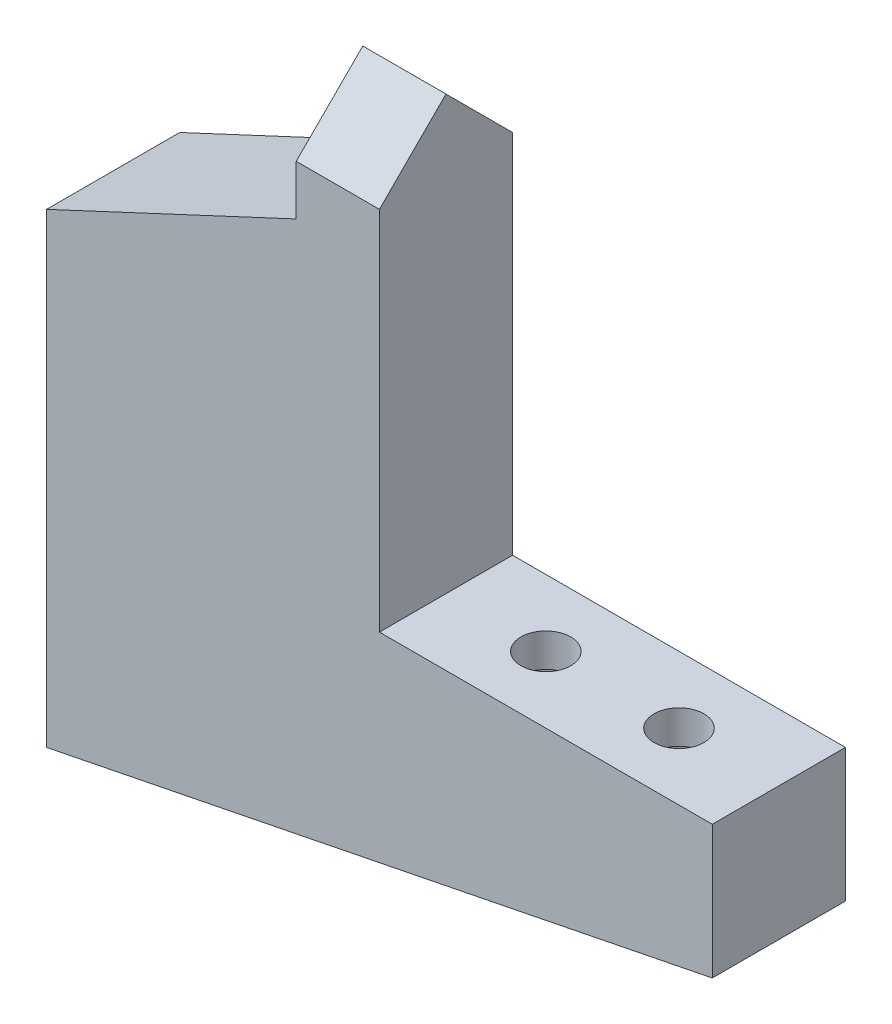
ISO-10303-21;
HEADER;
FILE_DESCRIPTION(('STEP AP214'),'2;1');
FILE_NAME('part.step','',(''),(''),'','','');
FILE_SCHEMA(('AUTOMOTIVE_DESIGN { 1 0 10303 214 1 1 1 1 }'));
ENDSEC;
DATA;
#1=APPLICATION_CONTEXT('core data for automotive mechanical design processes');
#2=APPLICATION_PROTOCOL_DEFINITION('international standard','automotive_design',2000,#1);
#3=PRODUCT_CONTEXT('',#1,'mechanical');
#4=PRODUCT('Part','Part','',(#3));
#5=PRODUCT_RELATED_PRODUCT_CATEGORY('part','',(#4));
#6=PRODUCT_DEFINITION_FORMATION('','',#4);
#7=PRODUCT_DEFINITION_CONTEXT('part definition',#1,'design');
#8=PRODUCT_DEFINITION('design','',#6,#7);
#9=PRODUCT_DEFINITION_SHAPE('','',#8);
#10=(LENGTH_UNIT() NAMED_UNIT(*) SI_UNIT(.MILLI.,.METRE.));
#11=(NAMED_UNIT(*) PLANE_ANGLE_UNIT() SI_UNIT($,.RADIAN.));
#12=(NAMED_UNIT(*) SI_UNIT($,.STERADIAN.) SOLID_ANGLE_UNIT());
#13=UNCERTAINTY_MEASURE_WITH_UNIT(LENGTH_MEASURE(1.E-05),#10,'distance_accuracy_value','');
#14=(GEOMETRIC_REPRESENTATION_CONTEXT(3) GLOBAL_UNCERTAINTY_ASSIGNED_CONTEXT((#13)) GLOBAL_UNIT_ASSIGNED_CONTEXT((#10,
#11,#12)) REPRESENTATION_CONTEXT('',''));
#15=CARTESIAN_POINT('',(0.,0.,0.));
#16=DIRECTION('',(0.,0.,1.));
#17=DIRECTION('',(1.,0.,0.));
#18=AXIS2_PLACEMENT_3D('',#15,#16,#17);
#19=CARTESIAN_POINT('',(40.,7.99999999999998,8.));
#20=DIRECTION('',(-0.196116135138183,0.98058067569092,0.));
#21=DIRECTION('',(-0.98058067569092,-0.196116135138183,0.));
#22=AXIS2_PLACEMENT_3D('',#19,#20,#21);
#23=PLANE('',#22);
#24=CARTESIAN_POINT('',(34.,6.79999999999998,4.));
#25=DIRECTION('',(-0.196116135138183,0.98058067569092,0.));
#26=DIRECTION('',(0.98058067569092,0.196116135138183,0.));
#27=AXIS2_PLACEMENT_3D('',#24,#25,#26);
#28=ELLIPSE('',#27,2.54950975679639,2.5);
#29=CARTESIAN_POINT('',(36.5,7.29999999999998,4.));
#30=VERTEX_POINT('',#29);
#31=EDGE_CURVE('E167',#30,#30,#28,.T.);
#32=ORIENTED_EDGE('',*,*,#31,.T.);
#33=EDGE_LOOP('',(#32));
#34=FACE_BOUND('',#33,.T.);
#35=CARTESIAN_POINT('',(26.,5.19999999999999,4.));
#36=DIRECTION('',(-0.196116135138183,0.98058067569092,0.));
#37=DIRECTION('',(0.98058067569092,0.196116135138183,0.));
#38=AXIS2_PLACEMENT_3D('',#35,#36,#37);
#39=ELLIPSE('',#38,2.54950975679639,2.5);
#40=CARTESIAN_POINT('',(28.5,5.69999999999999,4.));
#41=VERTEX_POINT('',#40);
#42=EDGE_CURVE('E160',#41,#41,#39,.T.);
#43=ORIENTED_EDGE('',*,*,#42,.T.);
#44=EDGE_LOOP('',(#43));
#45=FACE_BOUND('',#44,.T.);
#46=DIRECTION('',(0.98058067569092,0.196116135138183,0.));
#47=VECTOR('',#46,1.);
#48=CARTESIAN_POINT('',(40.,7.99999999999998,0.));
#49=LINE('',#48,#47);
#50=CARTESIAN_POINT('',(0.,0.,0.));
#51=VERTEX_POINT('',#50);
#52=CARTESIAN_POINT('',(40.,7.99999999999998,0.));
#53=VERTEX_POINT('',#52);
#54=EDGE_CURVE('E189',#51,#53,#49,.T.);
#55=ORIENTED_EDGE('',*,*,#54,.T.);
#56=DIRECTION('',(0.,0.,-1.));
#57=VECTOR('',#56,1.);
#58=CARTESIAN_POINT('',(40.,7.99999999999998,8.));
#59=LINE('',#58,#57);
#60=CARTESIAN_POINT('',(40.,7.99999999999998,8.));
#61=VERTEX_POINT('',#60);
#62=EDGE_CURVE('E46',#61,#53,#59,.T.);
#63=ORIENTED_EDGE('',*,*,#62,.F.);
#64=DIRECTION('',(0.98058067569092,0.196116135138183,0.));
#65=VECTOR('',#64,1.);
#66=CARTESIAN_POINT('',(40.,7.99999999999998,8.));
#67=LINE('',#66,#65);
#68=CARTESIAN_POINT('',(0.,0.,8.));
#69=VERTEX_POINT('',#68);
#70=EDGE_CURVE('E191',#69,#61,#67,.T.);
#71=ORIENTED_EDGE('',*,*,#70,.F.);
#72=DIRECTION('',(0.,0.,-1.));
#73=VECTOR('',#72,1.);
#74=CARTESIAN_POINT('',(0.,0.,8.));
#75=LINE('',#74,#73);
#76=EDGE_CURVE('E204',#69,#51,#75,.T.);
#77=ORIENTED_EDGE('',*,*,#76,.T.);
#78=EDGE_LOOP('',(#55,#63,#71,#77));
#79=FACE_BOUND('',#78,.T.);
#80=ADVANCED_FACE('F39',(#34,#45,#79),#23,.F.);
#81=CARTESIAN_POINT('',(40.,16.,8.));
#82=DIRECTION('',(-1.,0.,0.));
#83=DIRECTION('',(0.,0.,1.));
#84=AXIS2_PLACEMENT_3D('',#81,#82,#83);
#85=PLANE('',#84);
#86=DIRECTION('',(0.,1.,0.));
#87=VECTOR('',#86,1.);
#88=CARTESIAN_POINT('',(40.,16.,0.));
#89=LINE('',#88,#87);
#90=CARTESIAN_POINT('',(40.,16.,0.));
#91=VERTEX_POINT('',#90);
#92=EDGE_CURVE('E207',#53,#91,#89,.T.);
#93=ORIENTED_EDGE('',*,*,#92,.T.);
#94=DIRECTION('',(0.,0.,-1.));
#95=VECTOR('',#94,1.);
#96=CARTESIAN_POINT('',(40.,16.,8.));
#97=LINE('',#96,#95);
#98=CARTESIAN_POINT('',(40.,16.,8.));
#99=VERTEX_POINT('',#98);
#100=EDGE_CURVE('E220',#99,#91,#97,.T.);
#101=ORIENTED_EDGE('',*,*,#100,.F.);
#102=DIRECTION('',(0.,1.,0.));
#103=VECTOR('',#102,1.);
#104=CARTESIAN_POINT('',(40.,16.,8.));
#105=LINE('',#104,#103);
#106=EDGE_CURVE('E194',#61,#99,#105,.T.);
#107=ORIENTED_EDGE('',*,*,#106,.F.);
#108=ORIENTED_EDGE('',*,*,#62,.T.);
#109=EDGE_LOOP('',(#93,#101,#107,#108));
#110=FACE_BOUND('',#109,.T.);
#111=ADVANCED_FACE('F248',(#110),#85,.F.);
#112=CARTESIAN_POINT('',(20.,16.,8.));
#113=DIRECTION('',(0.,-1.,0.));
#114=DIRECTION('',(1.,0.,0.));
#115=AXIS2_PLACEMENT_3D('',#112,#113,#114);
#116=PLANE('',#115);
#117=CARTESIAN_POINT('',(34.,16.,4.));
#118=DIRECTION('',(0.,1.,0.));
#119=DIRECTION('',(-1.,0.,0.));
#120=AXIS2_PLACEMENT_3D('',#117,#118,#119);
#121=CIRCLE('',#120,1.5);
#122=CARTESIAN_POINT('',(32.5,16.,4.));
#123=VERTEX_POINT('',#122);
#124=EDGE_CURVE('E168',#123,#123,#121,.T.);
#125=ORIENTED_EDGE('',*,*,#124,.F.);
#126=EDGE_LOOP('',(#125));
#127=FACE_BOUND('',#126,.T.);
#128=CARTESIAN_POINT('',(26.,16.,4.));
#129=DIRECTION('',(0.,1.,0.));
#130=DIRECTION('',(-1.,0.,0.));
#131=AXIS2_PLACEMENT_3D('',#128,#129,#130);
#132=CIRCLE('',#131,1.5);
#133=CARTESIAN_POINT('',(24.5,16.,4.));
#134=VERTEX_POINT('',#133);
#135=EDGE_CURVE('E172',#134,#134,#132,.T.);
#136=ORIENTED_EDGE('',*,*,#135,.F.);
#137=EDGE_LOOP('',(#136));
#138=FACE_BOUND('',#137,.T.);
#139=DIRECTION('',(-1.,0.,0.));
#140=VECTOR('',#139,1.);
#141=CARTESIAN_POINT('',(20.,16.,0.));
#142=LINE('',#141,#140);
#143=CARTESIAN_POINT('',(20.,16.,0.));
#144=VERTEX_POINT('',#143);
#145=EDGE_CURVE('E209',#91,#144,#142,.T.);
#146=ORIENTED_EDGE('',*,*,#145,.T.);
#147=DIRECTION('',(0.,0.,-1.));
#148=VECTOR('',#147,1.);
#149=CARTESIAN_POINT('',(20.,16.,8.));
#150=LINE('',#149,#148);
#151=CARTESIAN_POINT('',(20.,16.,8.));
#152=VERTEX_POINT('',#151);
#153=EDGE_CURVE('E217',#152,#144,#150,.T.);
#154=ORIENTED_EDGE('',*,*,#153,.F.);
#155=DIRECTION('',(-1.,0.,0.));
#156=VECTOR('',#155,1.);
#157=CARTESIAN_POINT('',(20.,16.,8.));
#158=LINE('',#157,#156);
#159=EDGE_CURVE('E197',#99,#152,#158,.T.);
#160=ORIENTED_EDGE('',*,*,#159,.F.);
#161=ORIENTED_EDGE('',*,*,#100,.T.);
#162=EDGE_LOOP('',(#146,#154,#160,#161));
#163=FACE_BOUND('',#162,.T.);
#164=ADVANCED_FACE('F252',(#127,#138,#163),#116,.F.);
#165=CARTESIAN_POINT('',(20.,42.,8.));
#166=DIRECTION('',(-1.,0.,0.));
#167=DIRECTION('',(0.,-1.,0.));
#168=AXIS2_PLACEMENT_3D('',#165,#166,#167);
#169=PLANE('',#168);
#170=DIRECTION('',(0.,1.,0.));
#171=VECTOR('',#170,1.);
#172=CARTESIAN_POINT('',(20.,42.,0.));
#173=LINE('',#172,#171);
#174=CARTESIAN_POINT('',(20.,38.,0.));
#175=VERTEX_POINT('',#174);
#176=EDGE_CURVE('E211',#144,#175,#173,.T.);
#177=ORIENTED_EDGE('',*,*,#176,.T.);
#178=DIRECTION('',(0.,-0.707106781186547,-0.707106781186548));
#179=VECTOR('',#178,1.);
#180=CARTESIAN_POINT('',(20.,42.,4.));
#181=LINE('',#180,#179);
#182=CARTESIAN_POINT('',(20.,42.,4.));
#183=VERTEX_POINT('',#182);
#184=EDGE_CURVE('E143',#183,#175,#181,.T.);
#185=ORIENTED_EDGE('',*,*,#184,.F.);
#186=DIRECTION('',(0.,0.707106781186548,-0.707106781186547));
#187=VECTOR('',#186,1.);
#188=CARTESIAN_POINT('',(20.,42.,4.));
#189=LINE('',#188,#187);
#190=CARTESIAN_POINT('',(20.,38.,8.));
#191=VERTEX_POINT('',#190);
#192=EDGE_CURVE('E149',#191,#183,#189,.T.);
#193=ORIENTED_EDGE('',*,*,#192,.F.);
#194=DIRECTION('',(0.,1.,0.));
#195=VECTOR('',#194,1.);
#196=CARTESIAN_POINT('',(20.,42.,8.));
#197=LINE('',#196,#195);
#198=EDGE_CURVE('E199',#152,#191,#197,.T.);
#199=ORIENTED_EDGE('',*,*,#198,.F.);
#200=ORIENTED_EDGE('',*,*,#153,.T.);
#201=EDGE_LOOP('',(#177,#185,#193,#199,#200));
#202=FACE_BOUND('',#201,.T.);
#203=ADVANCED_FACE('F257',(#202),#169,.F.);
#204=CARTESIAN_POINT('',(0.,0.,8.));
#205=DIRECTION('',(1.,0.,0.));
#206=DIRECTION('',(0.,0.,-1.));
#207=AXIS2_PLACEMENT_3D('',#204,#205,#206);
#208=PLANE('',#207);
#209=CARTESIAN_POINT('',(0.,24.,4.));
#210=DIRECTION('',(-1.,0.,0.));
#211=DIRECTION('',(0.,0.,1.));
#212=AXIS2_PLACEMENT_3D('',#209,#210,#211);
#213=CIRCLE('',#212,0.799999999999999);
#214=CARTESIAN_POINT('',(0.,24.,4.8));
#215=VERTEX_POINT('',#214);
#216=EDGE_CURVE('E127',#215,#215,#213,.T.);
#217=ORIENTED_EDGE('',*,*,#216,.F.);
#218=EDGE_LOOP('',(#217));
#219=FACE_BOUND('',#218,.T.);
#220=CARTESIAN_POINT('',(0.,16.,4.));
#221=DIRECTION('',(-1.,0.,0.));
#222=DIRECTION('',(0.,0.,1.));
#223=AXIS2_PLACEMENT_3D('',#220,#221,#222);
#224=CIRCLE('',#223,0.799999999999999);
#225=CARTESIAN_POINT('',(0.,16.,4.8));
#226=VERTEX_POINT('',#225);
#227=EDGE_CURVE('E126',#226,#226,#224,.T.);
#228=ORIENTED_EDGE('',*,*,#227,.F.);
#229=EDGE_LOOP('',(#228));
#230=FACE_BOUND('',#229,.T.);
#231=CARTESIAN_POINT('',(0.,8.,4.));
#232=DIRECTION('',(-1.,0.,0.));
#233=DIRECTION('',(0.,0.,1.));
#234=AXIS2_PLACEMENT_3D('',#231,#232,#233);
#235=CIRCLE('',#234,0.8);
#236=CARTESIAN_POINT('',(0.,8.,4.8));
#237=VERTEX_POINT('',#236);
#238=EDGE_CURVE('E137',#237,#237,#235,.T.);
#239=ORIENTED_EDGE('',*,*,#238,.F.);
#240=EDGE_LOOP('',(#239));
#241=FACE_BOUND('',#240,.T.);
#242=DIRECTION('',(0.,-1.,0.));
#243=VECTOR('',#242,1.);
#244=CARTESIAN_POINT('',(0.,0.,8.));
#245=LINE('',#244,#243);
#246=CARTESIAN_POINT('',(0.,28.,8.));
#247=VERTEX_POINT('',#246);
#248=EDGE_CURVE('E202',#247,#69,#245,.T.);
#249=ORIENTED_EDGE('',*,*,#248,.F.);
#250=DIRECTION('',(0.,0.,1.));
#251=VECTOR('',#250,1.);
#252=CARTESIAN_POINT('',(0.,28.,0.));
#253=LINE('',#252,#251);
#254=CARTESIAN_POINT('',(0.,28.,0.));
#255=VERTEX_POINT('',#254);
#256=EDGE_CURVE('E182',#255,#247,#253,.T.);
#257=ORIENTED_EDGE('',*,*,#256,.F.);
#258=DIRECTION('',(0.,-1.,0.));
#259=VECTOR('',#258,1.);
#260=CARTESIAN_POINT('',(0.,0.,0.));
#261=LINE('',#260,#259);
#262=EDGE_CURVE('E195',#255,#51,#261,.T.);
#263=ORIENTED_EDGE('',*,*,#262,.T.);
#264=ORIENTED_EDGE('',*,*,#76,.F.);
#265=EDGE_LOOP('',(#249,#257,#263,#264));
#266=FACE_BOUND('',#265,.T.);
#267=ADVANCED_FACE('F263',(#219,#230,#241,#266),#208,.F.);
#268=CARTESIAN_POINT('',(0.,0.,8.));
#269=DIRECTION('',(0.,0.,-1.));
#270=DIRECTION('',(-1.,0.,0.));
#271=AXIS2_PLACEMENT_3D('',#268,#269,#270);
#272=PLANE('',#271);
#273=ORIENTED_EDGE('',*,*,#198,.T.);
#274=DIRECTION('',(1.,0.,0.));
#275=VECTOR('',#274,1.);
#276=CARTESIAN_POINT('',(0.,38.,8.));
#277=LINE('',#276,#275);
#278=CARTESIAN_POINT('',(15.,38.,8.));
#279=VERTEX_POINT('',#278);
#280=EDGE_CURVE('E152',#279,#191,#277,.T.);
#281=ORIENTED_EDGE('',*,*,#280,.F.);
#282=DIRECTION('',(0.,1.,0.));
#283=VECTOR('',#282,1.);
#284=CARTESIAN_POINT('',(15.,42.,8.));
#285=LINE('',#284,#283);
#286=CARTESIAN_POINT('',(15.,35.,8.));
#287=VERTEX_POINT('',#286);
#288=EDGE_CURVE('E180',#287,#279,#285,.T.);
#289=ORIENTED_EDGE('',*,*,#288,.F.);
#290=DIRECTION('',(0.906183139995265,0.422885465331124,0.));
#291=VECTOR('',#290,1.);
#292=CARTESIAN_POINT('',(15.,35.,8.));
#293=LINE('',#292,#291);
#294=EDGE_CURVE('E171',#247,#287,#293,.T.);
#295=ORIENTED_EDGE('',*,*,#294,.F.);
#296=ORIENTED_EDGE('',*,*,#248,.T.);
#297=ORIENTED_EDGE('',*,*,#70,.T.);
#298=ORIENTED_EDGE('',*,*,#106,.T.);
#299=ORIENTED_EDGE('',*,*,#159,.T.);
#300=EDGE_LOOP('',(#273,#281,#289,#295,#296,#297,#298,#299));
#301=FACE_BOUND('',#300,.T.);
#302=ADVANCED_FACE('F267',(#301),#272,.F.);
#303=CARTESIAN_POINT('',(0.,0.,0.));
#304=DIRECTION('',(0.,0.,-1.));
#305=DIRECTION('',(-1.,0.,0.));
#306=AXIS2_PLACEMENT_3D('',#303,#304,#305);
#307=PLANE('',#306);
#308=DIRECTION('',(1.,0.,0.));
#309=VECTOR('',#308,1.);
#310=CARTESIAN_POINT('',(0.,38.,0.));
#311=LINE('',#310,#309);
#312=CARTESIAN_POINT('',(15.,38.,0.));
#313=VERTEX_POINT('',#312);
#314=EDGE_CURVE('E145',#313,#175,#311,.T.);
#315=ORIENTED_EDGE('',*,*,#314,.T.);
#316=ORIENTED_EDGE('',*,*,#176,.F.);
#317=ORIENTED_EDGE('',*,*,#145,.F.);
#318=ORIENTED_EDGE('',*,*,#92,.F.);
#319=ORIENTED_EDGE('',*,*,#54,.F.);
#320=ORIENTED_EDGE('',*,*,#262,.F.);
#321=DIRECTION('',(0.906183139995265,0.422885465331124,0.));
#322=VECTOR('',#321,1.);
#323=CARTESIAN_POINT('',(15.,35.,0.));
#324=LINE('',#323,#322);
#325=CARTESIAN_POINT('',(15.,35.,0.));
#326=VERTEX_POINT('',#325);
#327=EDGE_CURVE('E177',#255,#326,#324,.T.);
#328=ORIENTED_EDGE('',*,*,#327,.T.);
#329=DIRECTION('',(0.,1.,0.));
#330=VECTOR('',#329,1.);
#331=CARTESIAN_POINT('',(15.,42.,0.));
#332=LINE('',#331,#330);
#333=EDGE_CURVE('E60',#326,#313,#332,.T.);
#334=ORIENTED_EDGE('',*,*,#333,.T.);
#335=EDGE_LOOP('',(#315,#316,#317,#318,#319,#320,#328,#334));
#336=FACE_BOUND('',#335,.T.);
#337=ADVANCED_FACE('F269',(#336),#307,.T.);
#338=CARTESIAN_POINT('',(15.,42.,0.));
#339=DIRECTION('',(1.,0.,0.));
#340=DIRECTION('',(0.,0.,-1.));
#341=AXIS2_PLACEMENT_3D('',#338,#339,#340);
#342=PLANE('',#341);
#343=DIRECTION('',(0.,0.707106781186548,-0.707106781186547));
#344=VECTOR('',#343,1.);
#345=CARTESIAN_POINT('',(15.,44.,2.));
#346=LINE('',#345,#344);
#347=CARTESIAN_POINT('',(15.,42.,3.99999999999999));
#348=VERTEX_POINT('',#347);
#349=EDGE_CURVE('E11',#279,#348,#346,.T.);
#350=ORIENTED_EDGE('',*,*,#349,.T.);
#351=DIRECTION('',(0.,-0.707106781186547,-0.707106781186548));
#352=VECTOR('',#351,1.);
#353=CARTESIAN_POINT('',(15.,40.,2.));
#354=LINE('',#353,#352);
#355=EDGE_CURVE('E53',#348,#313,#354,.T.);
#356=ORIENTED_EDGE('',*,*,#355,.T.);
#357=ORIENTED_EDGE('',*,*,#333,.F.);
#358=DIRECTION('',(0.,0.,1.));
#359=VECTOR('',#358,1.);
#360=CARTESIAN_POINT('',(15.,35.,0.));
#361=LINE('',#360,#359);
#362=EDGE_CURVE('E187',#326,#287,#361,.T.);
#363=ORIENTED_EDGE('',*,*,#362,.T.);
#364=ORIENTED_EDGE('',*,*,#288,.T.);
#365=EDGE_LOOP('',(#350,#356,#357,#363,#364));
#366=FACE_BOUND('',#365,.T.);
#367=ADVANCED_FACE('F272',(#366),#342,.F.);
#368=CARTESIAN_POINT('',(15.,35.,0.));
#369=DIRECTION('',(0.422885465331124,-0.906183139995266,0.));
#370=DIRECTION('',(0.906183139995266,0.422885465331124,0.));
#371=AXIS2_PLACEMENT_3D('',#368,#369,#370);
#372=PLANE('',#371);
#373=ORIENTED_EDGE('',*,*,#294,.T.);
#374=ORIENTED_EDGE('',*,*,#362,.F.);
#375=ORIENTED_EDGE('',*,*,#327,.F.);
#376=ORIENTED_EDGE('',*,*,#256,.T.);
#377=EDGE_LOOP('',(#373,#374,#375,#376));
#378=FACE_BOUND('',#377,.T.);
#379=ADVANCED_FACE('F277',(#378),#372,.F.);
#380=CARTESIAN_POINT('',(26.,14.,4.));
#381=DIRECTION('',(0.,1.,0.));
#382=DIRECTION('',(-1.,0.,0.));
#383=AXIS2_PLACEMENT_3D('',#380,#381,#382);
#384=CYLINDRICAL_SURFACE('',#383,1.5);
#385=CARTESIAN_POINT('',(26.,14.,4.));
#386=DIRECTION('',(0.,1.,0.));
#387=DIRECTION('',(-1.,0.,0.));
#388=AXIS2_PLACEMENT_3D('',#385,#386,#387);
#389=CIRCLE('',#388,1.5);
#390=CARTESIAN_POINT('',(24.5,14.,4.));
#391=VERTEX_POINT('',#390);
#392=EDGE_CURVE('E166',#391,#391,#389,.T.);
#393=ORIENTED_EDGE('',*,*,#392,.F.);
#394=EDGE_LOOP('',(#393));
#395=FACE_BOUND('',#394,.T.);
#396=ORIENTED_EDGE('',*,*,#135,.T.);
#397=EDGE_LOOP('',(#396));
#398=FACE_BOUND('',#397,.T.);
#399=ADVANCED_FACE('F280',(#395,#398),#384,.F.);
#400=CARTESIAN_POINT('',(34.,14.,4.));
#401=DIRECTION('',(0.,1.,0.));
#402=DIRECTION('',(-1.,0.,0.));
#403=AXIS2_PLACEMENT_3D('',#400,#401,#402);
#404=CYLINDRICAL_SURFACE('',#403,1.5);
#405=CARTESIAN_POINT('',(34.,14.,4.));
#406=DIRECTION('',(0.,1.,0.));
#407=DIRECTION('',(-1.,0.,0.));
#408=AXIS2_PLACEMENT_3D('',#405,#406,#407);
#409=CIRCLE('',#408,1.5);
#410=CARTESIAN_POINT('',(32.5,14.,4.));
#411=VERTEX_POINT('',#410);
#412=EDGE_CURVE('E163',#411,#411,#409,.T.);
#413=ORIENTED_EDGE('',*,*,#412,.F.);
#414=EDGE_LOOP('',(#413));
#415=FACE_BOUND('',#414,.T.);
#416=ORIENTED_EDGE('',*,*,#124,.T.);
#417=EDGE_LOOP('',(#416));
#418=FACE_BOUND('',#417,.T.);
#419=ADVANCED_FACE('F286',(#415,#418),#404,.F.);
#420=CARTESIAN_POINT('',(26.,0.,4.));
#421=DIRECTION('',(0.,1.,0.));
#422=DIRECTION('',(-1.,0.,0.));
#423=AXIS2_PLACEMENT_3D('',#420,#421,#422);
#424=CYLINDRICAL_SURFACE('',#423,2.5);
#425=CARTESIAN_POINT('',(26.,14.,4.));
#426=DIRECTION('',(0.,1.,0.));
#427=DIRECTION('',(-1.,0.,0.));
#428=AXIS2_PLACEMENT_3D('',#425,#426,#427);
#429=CIRCLE('',#428,2.5);
#430=CARTESIAN_POINT('',(23.5,14.,4.));
#431=VERTEX_POINT('',#430);
#432=EDGE_CURVE('E155',#431,#431,#429,.T.);
#433=ORIENTED_EDGE('',*,*,#432,.T.);
#434=EDGE_LOOP('',(#433));
#435=FACE_BOUND('',#434,.T.);
#436=ORIENTED_EDGE('',*,*,#42,.F.);
#437=EDGE_LOOP('',(#436));
#438=FACE_BOUND('',#437,.T.);
#439=ADVANCED_FACE('F244',(#435,#438),#424,.F.);
#440=CARTESIAN_POINT('',(26.,14.,4.));
#441=DIRECTION('',(0.,1.,0.));
#442=DIRECTION('',(-1.,0.,0.));
#443=AXIS2_PLACEMENT_3D('',#440,#441,#442);
#444=PLANE('',#443);
#445=ORIENTED_EDGE('',*,*,#392,.T.);
#446=EDGE_LOOP('',(#445));
#447=FACE_BOUND('',#446,.T.);
#448=ORIENTED_EDGE('',*,*,#432,.F.);
#449=EDGE_LOOP('',(#448));
#450=FACE_BOUND('',#449,.T.);
#451=ADVANCED_FACE('F234',(#447,#450),#444,.F.);
#452=CARTESIAN_POINT('',(34.,0.,4.));
#453=DIRECTION('',(0.,1.,0.));
#454=DIRECTION('',(-1.,0.,0.));
#455=AXIS2_PLACEMENT_3D('',#452,#453,#454);
#456=CYLINDRICAL_SURFACE('',#455,2.5);
#457=CARTESIAN_POINT('',(34.,14.,4.));
#458=DIRECTION('',(0.,1.,0.));
#459=DIRECTION('',(-1.,0.,0.));
#460=AXIS2_PLACEMENT_3D('',#457,#458,#459);
#461=CIRCLE('',#460,2.5);
#462=CARTESIAN_POINT('',(31.5,14.,4.));
#463=VERTEX_POINT('',#462);
#464=EDGE_CURVE('E157',#463,#463,#461,.T.);
#465=ORIENTED_EDGE('',*,*,#464,.T.);
#466=EDGE_LOOP('',(#465));
#467=FACE_BOUND('',#466,.T.);
#468=ORIENTED_EDGE('',*,*,#31,.F.);
#469=EDGE_LOOP('',(#468));
#470=FACE_BOUND('',#469,.T.);
#471=ADVANCED_FACE('F231',(#467,#470),#456,.F.);
#472=CARTESIAN_POINT('',(34.,14.,4.));
#473=DIRECTION('',(0.,1.,0.));
#474=DIRECTION('',(-1.,0.,0.));
#475=AXIS2_PLACEMENT_3D('',#472,#473,#474);
#476=PLANE('',#475);
#477=ORIENTED_EDGE('',*,*,#412,.T.);
#478=EDGE_LOOP('',(#477));
#479=FACE_BOUND('',#478,.T.);
#480=ORIENTED_EDGE('',*,*,#464,.F.);
#481=EDGE_LOOP('',(#480));
#482=FACE_BOUND('',#481,.T.);
#483=ADVANCED_FACE('F233',(#479,#482),#476,.F.);
#484=CARTESIAN_POINT('',(0.,42.,4.));
#485=DIRECTION('',(0.,-0.707106781186547,-0.707106781186548));
#486=DIRECTION('',(0.,0.707106781186548,-0.707106781186547));
#487=AXIS2_PLACEMENT_3D('',#484,#485,#486);
#488=PLANE('',#487);
#489=ORIENTED_EDGE('',*,*,#280,.T.);
#490=ORIENTED_EDGE('',*,*,#192,.T.);
#491=DIRECTION('',(1.,0.,0.));
#492=VECTOR('',#491,1.);
#493=CARTESIAN_POINT('',(0.,42.,4.));
#494=LINE('',#493,#492);
#495=EDGE_CURVE('E153',#348,#183,#494,.T.);
#496=ORIENTED_EDGE('',*,*,#495,.F.);
#497=ORIENTED_EDGE('',*,*,#349,.F.);
#498=EDGE_LOOP('',(#489,#490,#496,#497));
#499=FACE_BOUND('',#498,.T.);
#500=ADVANCED_FACE('F241',(#499),#488,.F.);
#501=CARTESIAN_POINT('',(0.,42.,4.));
#502=DIRECTION('',(0.,-0.707106781186548,0.707106781186547));
#503=DIRECTION('',(0.,-0.707106781186547,-0.707106781186548));
#504=AXIS2_PLACEMENT_3D('',#501,#502,#503);
#505=PLANE('',#504);
#506=ORIENTED_EDGE('',*,*,#495,.T.);
#507=ORIENTED_EDGE('',*,*,#184,.T.);
#508=ORIENTED_EDGE('',*,*,#314,.F.);
#509=ORIENTED_EDGE('',*,*,#355,.F.);
#510=EDGE_LOOP('',(#506,#507,#508,#509));
#511=FACE_BOUND('',#510,.T.);
#512=ADVANCED_FACE('F320',(#511),#505,.F.);
#513=CARTESIAN_POINT('',(8.,8.,4.));
#514=DIRECTION('',(-1.,0.,0.));
#515=DIRECTION('',(0.,0.,1.));
#516=AXIS2_PLACEMENT_3D('',#513,#514,#515);
#517=CONICAL_SURFACE('',#516,0.799999999999999,1.02974425867665);
#518=CARTESIAN_POINT('',(8.48068849522205,8.,4.));
#519=VERTEX_POINT('',#518);
#520=VERTEX_LOOP('',#519);
#521=FACE_BOUND('',#520,.T.);
#522=CARTESIAN_POINT('',(8.,8.,4.));
#523=DIRECTION('',(-1.,0.,0.));
#524=DIRECTION('',(0.,0.,1.));
#525=AXIS2_PLACEMENT_3D('',#522,#523,#524);
#526=CIRCLE('',#525,0.799999999999999);
#527=CARTESIAN_POINT('',(8.,8.,4.8));
#528=VERTEX_POINT('',#527);
#529=EDGE_CURVE('E140',#528,#528,#526,.T.);
#530=ORIENTED_EDGE('',*,*,#529,.T.);
#531=EDGE_LOOP('',(#530));
#532=FACE_BOUND('',#531,.T.);
#533=ADVANCED_FACE('F322',(#521,#532),#517,.F.);
#534=CARTESIAN_POINT('',(0.,8.,4.));
#535=DIRECTION('',(-1.,0.,0.));
#536=DIRECTION('',(0.,0.,1.));
#537=AXIS2_PLACEMENT_3D('',#534,#535,#536);
#538=CYLINDRICAL_SURFACE('',#537,0.799999999999999);
#539=ORIENTED_EDGE('',*,*,#529,.F.);
#540=EDGE_LOOP('',(#539));
#541=FACE_BOUND('',#540,.T.);
#542=ORIENTED_EDGE('',*,*,#238,.T.);
#543=EDGE_LOOP('',(#542));
#544=FACE_BOUND('',#543,.T.);
#545=ADVANCED_FACE('F328',(#541,#544),#538,.F.);
#546=CARTESIAN_POINT('',(8.,16.,4.));
#547=DIRECTION('',(-1.,0.,0.));
#548=DIRECTION('',(0.,0.,1.));
#549=AXIS2_PLACEMENT_3D('',#546,#547,#548);
#550=CONICAL_SURFACE('',#549,0.799999999999999,1.02974425867665);
#551=CARTESIAN_POINT('',(8.48068849522205,16.,4.));
#552=VERTEX_POINT('',#551);
#553=VERTEX_LOOP('',#552);
#554=FACE_BOUND('',#553,.T.);
#555=CARTESIAN_POINT('',(8.,16.,4.));
#556=DIRECTION('',(-1.,0.,0.));
#557=DIRECTION('',(0.,0.,1.));
#558=AXIS2_PLACEMENT_3D('',#555,#556,#557);
#559=CIRCLE('',#558,0.799999999999999);
#560=CARTESIAN_POINT('',(8.,16.,4.8));
#561=VERTEX_POINT('',#560);
#562=EDGE_CURVE('E130',#561,#561,#559,.T.);
#563=ORIENTED_EDGE('',*,*,#562,.T.);
#564=EDGE_LOOP('',(#563));
#565=FACE_BOUND('',#564,.T.);
#566=ADVANCED_FACE('F335',(#554,#565),#550,.F.);
#567=CARTESIAN_POINT('',(0.,16.,4.));
#568=DIRECTION('',(-1.,0.,0.));
#569=DIRECTION('',(0.,0.,1.));
#570=AXIS2_PLACEMENT_3D('',#567,#568,#569);
#571=CYLINDRICAL_SURFACE('',#570,0.799999999999999);
#572=ORIENTED_EDGE('',*,*,#562,.F.);
#573=EDGE_LOOP('',(#572));
#574=FACE_BOUND('',#573,.T.);
#575=ORIENTED_EDGE('',*,*,#227,.T.);
#576=EDGE_LOOP('',(#575));
#577=FACE_BOUND('',#576,.T.);
#578=ADVANCED_FACE('F120',(#574,#577),#571,.F.);
#579=CARTESIAN_POINT('',(8.,24.,4.));
#580=DIRECTION('',(-1.,0.,0.));
#581=DIRECTION('',(0.,0.,1.));
#582=AXIS2_PLACEMENT_3D('',#579,#580,#581);
#583=CONICAL_SURFACE('',#582,0.799999999999999,1.02974425867665);
#584=CARTESIAN_POINT('',(8.48068849522205,24.,4.));
#585=VERTEX_POINT('',#584);
#586=VERTEX_LOOP('',#585);
#587=FACE_BOUND('',#586,.T.);
#588=CARTESIAN_POINT('',(8.,24.,4.));
#589=DIRECTION('',(-1.,0.,0.));
#590=DIRECTION('',(0.,0.,1.));
#591=AXIS2_PLACEMENT_3D('',#588,#589,#590);
#592=CIRCLE('',#591,0.799999999999999);
#593=CARTESIAN_POINT('',(8.,24.,4.8));
#594=VERTEX_POINT('',#593);
#595=EDGE_CURVE('E124',#594,#594,#592,.T.);
#596=ORIENTED_EDGE('',*,*,#595,.T.);
#597=EDGE_LOOP('',(#596));
#598=FACE_BOUND('',#597,.T.);
#599=ADVANCED_FACE('F116',(#587,#598),#583,.F.);
#600=CARTESIAN_POINT('',(0.,24.,4.));
#601=DIRECTION('',(-1.,0.,0.));
#602=DIRECTION('',(0.,0.,1.));
#603=AXIS2_PLACEMENT_3D('',#600,#601,#602);
#604=CYLINDRICAL_SURFACE('',#603,0.799999999999999);
#605=ORIENTED_EDGE('',*,*,#595,.F.);
#606=EDGE_LOOP('',(#605));
#607=FACE_BOUND('',#606,.T.);
#608=ORIENTED_EDGE('',*,*,#216,.T.);
#609=EDGE_LOOP('',(#608));
#610=FACE_BOUND('',#609,.T.);
#611=ADVANCED_FACE('F119',(#607,#610),#604,.F.);
#612=CLOSED_SHELL('',(#80,#111,#164,#203,#267,#302,#337,#367,#379,#399,#419,#439,#451,#471,#483,
#500,#512,#533,#545,#566,#578,#599,#611));
#613=MANIFOLD_SOLID_BREP('B2',#612);
#614=ADVANCED_BREP_SHAPE_REPRESENTATION('',(#18,#613),#14);
#615=SHAPE_DEFINITION_REPRESENTATION(#9,#614);
ENDSEC;
END-ISO-10303-21;
